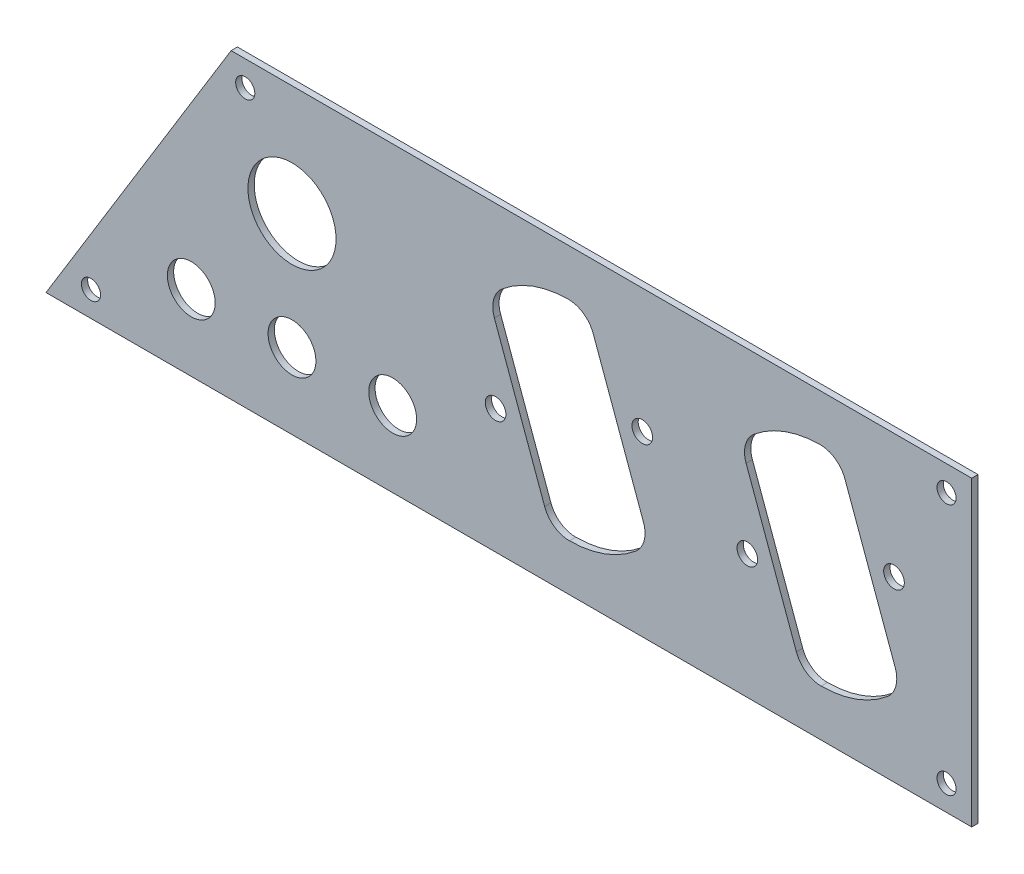
ISO-10303-21;
HEADER;
FILE_DESCRIPTION(('STEP AP214'),'2;1');
FILE_NAME('part.step','',(''),(''),'','','');
FILE_SCHEMA(('AUTOMOTIVE_DESIGN { 1 0 10303 214 1 1 1 1 }'));
ENDSEC;
DATA;
#1=APPLICATION_CONTEXT('core data for automotive mechanical design processes');
#2=APPLICATION_PROTOCOL_DEFINITION('international standard','automotive_design',2000,#1);
#3=PRODUCT_CONTEXT('',#1,'mechanical');
#4=PRODUCT('Part','Part','',(#3));
#5=PRODUCT_RELATED_PRODUCT_CATEGORY('part','',(#4));
#6=PRODUCT_DEFINITION_FORMATION('','',#4);
#7=PRODUCT_DEFINITION_CONTEXT('part definition',#1,'design');
#8=PRODUCT_DEFINITION('design','',#6,#7);
#9=PRODUCT_DEFINITION_SHAPE('','',#8);
#10=(LENGTH_UNIT() NAMED_UNIT(*) SI_UNIT(.MILLI.,.METRE.));
#11=(NAMED_UNIT(*) PLANE_ANGLE_UNIT() SI_UNIT($,.RADIAN.));
#12=(NAMED_UNIT(*) SI_UNIT($,.STERADIAN.) SOLID_ANGLE_UNIT());
#13=UNCERTAINTY_MEASURE_WITH_UNIT(LENGTH_MEASURE(1.E-05),#10,'distance_accuracy_value','');
#14=(GEOMETRIC_REPRESENTATION_CONTEXT(3) GLOBAL_UNCERTAINTY_ASSIGNED_CONTEXT((#13)) GLOBAL_UNIT_ASSIGNED_CONTEXT((#10,
#11,#12)) REPRESENTATION_CONTEXT('',''));
#15=CARTESIAN_POINT('',(0.,0.,0.));
#16=DIRECTION('',(0.,0.,1.));
#17=DIRECTION('',(1.,0.,0.));
#18=AXIS2_PLACEMENT_3D('',#15,#16,#17);
#19=CARTESIAN_POINT('',(0.,0.,1.5875));
#20=DIRECTION('',(0.,0.,1.));
#21=DIRECTION('',(1.,0.,0.));
#22=AXIS2_PLACEMENT_3D('',#19,#20,#21);
#23=PLANE('',#22);
#24=CARTESIAN_POINT('',(-83.1021507598293,-336.167333478634,1.5875));
#25=DIRECTION('',(0.,0.,1.));
#26=DIRECTION('',(1.,0.,0.));
#27=AXIS2_PLACEMENT_3D('',#24,#25,#26);
#28=CIRCLE('',#27,2.60349999999994);
#29=CARTESIAN_POINT('',(-80.4986507598294,-336.167333478634,1.5875));
#30=VERTEX_POINT('',#29);
#31=EDGE_CURVE('E256',#30,#30,#28,.T.);
#32=ORIENTED_EDGE('',*,*,#31,.F.);
#33=EDGE_LOOP('',(#32));
#34=FACE_BOUND('',#33,.T.);
#35=CARTESIAN_POINT('',(-19.6021507598293,-336.167333478634,1.5875));
#36=DIRECTION('',(0.,0.,1.));
#37=DIRECTION('',(1.,0.,0.));
#38=AXIS2_PLACEMENT_3D('',#35,#36,#37);
#39=CIRCLE('',#38,2.60349999999994);
#40=CARTESIAN_POINT('',(-16.9986507598294,-336.167333478634,1.5875));
#41=VERTEX_POINT('',#40);
#42=EDGE_CURVE('E328',#41,#41,#39,.T.);
#43=ORIENTED_EDGE('',*,*,#42,.F.);
#44=EDGE_LOOP('',(#43));
#45=FACE_BOUND('',#44,.T.);
#46=CARTESIAN_POINT('',(-222.156189245481,-374.65,1.5875));
#47=DIRECTION('',(0.,0.,1.));
#48=DIRECTION('',(1.,0.,0.));
#49=AXIS2_PLACEMENT_3D('',#46,#47,#48);
#50=CIRCLE('',#49,2.413);
#51=CARTESIAN_POINT('',(-219.743189245481,-374.65,1.5875));
#52=VERTEX_POINT('',#51);
#53=EDGE_CURVE('E340',#52,#52,#50,.T.);
#54=ORIENTED_EDGE('',*,*,#53,.F.);
#55=EDGE_LOOP('',(#54));
#56=FACE_BOUND('',#55,.T.);
#57=CARTESIAN_POINT('',(-6.34999999999997,-311.15,1.5875));
#58=DIRECTION('',(0.,0.,1.));
#59=DIRECTION('',(1.,0.,0.));
#60=AXIS2_PLACEMENT_3D('',#57,#58,#59);
#61=CIRCLE('',#60,2.413);
#62=CARTESIAN_POINT('',(-3.93699999999996,-311.15,1.5875));
#63=VERTEX_POINT('',#62);
#64=EDGE_CURVE('E352',#63,#63,#61,.T.);
#65=ORIENTED_EDGE('',*,*,#64,.F.);
#66=EDGE_LOOP('',(#65));
#67=FACE_BOUND('',#66,.T.);
#68=CARTESIAN_POINT('',(-171.45,-361.95,1.5875));
#69=DIRECTION('',(0.,0.,1.));
#70=DIRECTION('',(1.,0.,0.));
#71=AXIS2_PLACEMENT_3D('',#68,#69,#70);
#72=CIRCLE('',#71,6.03249999999993);
#73=CARTESIAN_POINT('',(-165.4175,-361.95,1.5875));
#74=VERTEX_POINT('',#73);
#75=EDGE_CURVE('E364',#74,#74,#72,.T.);
#76=ORIENTED_EDGE('',*,*,#75,.F.);
#77=EDGE_LOOP('',(#76));
#78=FACE_BOUND('',#77,.T.);
#79=CARTESIAN_POINT('',(-171.45,-332.74,1.5875));
#80=DIRECTION('',(0.,0.,1.));
#81=DIRECTION('',(1.,0.,0.));
#82=AXIS2_PLACEMENT_3D('',#79,#80,#81);
#83=CIRCLE('',#82,11.1125);
#84=CARTESIAN_POINT('',(-160.3375,-332.74,1.5875));
#85=VERTEX_POINT('',#84);
#86=EDGE_CURVE('E376',#85,#85,#83,.T.);
#87=ORIENTED_EDGE('',*,*,#86,.F.);
#88=EDGE_LOOP('',(#87));
#89=FACE_BOUND('',#88,.T.);
#90=DIRECTION('',(1.,0.,0.));
#91=VECTOR('',#90,1.);
#92=CARTESIAN_POINT('',(0.,-381.,1.5875));
#93=LINE('',#92,#91);
#94=CARTESIAN_POINT('',(-233.495394339495,-381.,1.5875));
#95=VERTEX_POINT('',#94);
#96=CARTESIAN_POINT('',(0.,-381.,1.5875));
#97=VERTEX_POINT('',#96);
#98=EDGE_CURVE('E382',#95,#97,#93,.T.);
#99=ORIENTED_EDGE('',*,*,#98,.T.);
#100=DIRECTION('',(0.,1.,0.));
#101=VECTOR('',#100,1.);
#102=CARTESIAN_POINT('',(0.,-304.8,1.5875));
#103=LINE('',#102,#101);
#104=CARTESIAN_POINT('',(0.,-304.8,1.5875));
#105=VERTEX_POINT('',#104);
#106=EDGE_CURVE('E385',#97,#105,#103,.T.);
#107=ORIENTED_EDGE('',*,*,#106,.T.);
#108=DIRECTION('',(-1.,0.,0.));
#109=VECTOR('',#108,1.);
#110=CARTESIAN_POINT('',(-186.796315471596,-304.8,1.5875));
#111=LINE('',#110,#109);
#112=CARTESIAN_POINT('',(-186.796315471596,-304.8,1.5875));
#113=VERTEX_POINT('',#112);
#114=EDGE_CURVE('E388',#105,#113,#111,.T.);
#115=ORIENTED_EDGE('',*,*,#114,.T.);
#116=DIRECTION('',(-0.522528327154028,-0.852621925194053,0.));
#117=VECTOR('',#116,1.);
#118=CARTESIAN_POINT('',(-233.495394339495,-381.,1.5875));
#119=LINE('',#118,#117);
#120=EDGE_CURVE('E390',#113,#95,#119,.T.);
#121=ORIENTED_EDGE('',*,*,#120,.T.);
#122=EDGE_LOOP('',(#99,#107,#115,#121));
#123=FACE_BOUND('',#122,.T.);
#124=CARTESIAN_POINT('',(-196.85,-361.95,1.5875));
#125=DIRECTION('',(0.,0.,1.));
#126=DIRECTION('',(1.,0.,0.));
#127=AXIS2_PLACEMENT_3D('',#124,#125,#126);
#128=CIRCLE('',#127,6.03249999999993);
#129=CARTESIAN_POINT('',(-190.8175,-361.95,1.5875));
#130=VERTEX_POINT('',#129);
#131=EDGE_CURVE('E370',#130,#130,#128,.T.);
#132=ORIENTED_EDGE('',*,*,#131,.F.);
#133=EDGE_LOOP('',(#132));
#134=FACE_BOUND('',#133,.T.);
#135=CARTESIAN_POINT('',(-146.05,-361.95,1.5875));
#136=DIRECTION('',(0.,0.,1.));
#137=DIRECTION('',(1.,0.,0.));
#138=AXIS2_PLACEMENT_3D('',#135,#136,#137);
#139=CIRCLE('',#138,6.03249999999993);
#140=CARTESIAN_POINT('',(-140.0175,-361.95,1.5875));
#141=VERTEX_POINT('',#140);
#142=EDGE_CURVE('E358',#141,#141,#139,.T.);
#143=ORIENTED_EDGE('',*,*,#142,.F.);
#144=EDGE_LOOP('',(#143));
#145=FACE_BOUND('',#144,.T.);
#146=CARTESIAN_POINT('',(-6.34999999999995,-374.65,1.5875));
#147=DIRECTION('',(0.,0.,1.));
#148=DIRECTION('',(1.,0.,0.));
#149=AXIS2_PLACEMENT_3D('',#146,#147,#148);
#150=CIRCLE('',#149,2.413);
#151=CARTESIAN_POINT('',(-3.93699999999995,-374.65,1.5875));
#152=VERTEX_POINT('',#151);
#153=EDGE_CURVE('E346',#152,#152,#150,.T.);
#154=ORIENTED_EDGE('',*,*,#153,.F.);
#155=EDGE_LOOP('',(#154));
#156=FACE_BOUND('',#155,.T.);
#157=CARTESIAN_POINT('',(-183.240290188899,-311.15,1.5875));
#158=DIRECTION('',(0.,0.,1.));
#159=DIRECTION('',(1.,0.,0.));
#160=AXIS2_PLACEMENT_3D('',#157,#158,#159);
#161=CIRCLE('',#160,2.413);
#162=CARTESIAN_POINT('',(-180.827290188899,-311.15,1.5875));
#163=VERTEX_POINT('',#162);
#164=EDGE_CURVE('E334',#163,#163,#161,.T.);
#165=ORIENTED_EDGE('',*,*,#164,.F.);
#166=EDGE_LOOP('',(#165));
#167=FACE_BOUND('',#166,.T.);
#168=CARTESIAN_POINT('',(-56.5978492401706,-349.632666521366,1.5875));
#169=DIRECTION('',(0.,0.,1.));
#170=DIRECTION('',(1.,0.,0.));
#171=AXIS2_PLACEMENT_3D('',#168,#169,#170);
#172=CIRCLE('',#171,2.60349999999996);
#173=CARTESIAN_POINT('',(-53.9943492401706,-349.632666521366,1.5875));
#174=VERTEX_POINT('',#173);
#175=EDGE_CURVE('E322',#174,#174,#172,.T.);
#176=ORIENTED_EDGE('',*,*,#175,.F.);
#177=EDGE_LOOP('',(#176));
#178=FACE_BOUND('',#177,.T.);
#179=CARTESIAN_POINT('',(-38.0847052467851,-342.942021989095,1.5875));
#180=DIRECTION('',(0.,0.,1.));
#181=DIRECTION('',(1.,0.,0.));
#182=AXIS2_PLACEMENT_3D('',#179,#180,#181);
#183=CIRCLE('',#182,26.2702188667497);
#184=CARTESIAN_POINT('',(-37.9837385493268,-369.212046827928,1.5875));
#185=VERTEX_POINT('',#184);
#186=CARTESIAN_POINT('',(-21.2760037517532,-363.130928679598,1.5875));
#187=VERTEX_POINT('',#186);
#188=EDGE_CURVE('E264',#185,#187,#183,.T.);
#189=ORIENTED_EDGE('',*,*,#188,.F.);
#190=CARTESIAN_POINT('',(-38.00912029713,-362.608095604087,1.5875));
#191=DIRECTION('',(0.,0.,1.));
#192=DIRECTION('',(1.,0.,0.));
#193=AXIS2_PLACEMENT_3D('',#190,#191,#192);
#194=CIRCLE('',#193,6.60399999999998);
#195=CARTESIAN_POINT('',(-44.2148503648002,-364.866796630609,1.5875));
#196=VERTEX_POINT('',#195);
#197=EDGE_CURVE('E262',#196,#185,#194,.T.);
#198=ORIENTED_EDGE('',*,*,#197,.F.);
#199=DIRECTION('',(0.342020143325664,-0.93969262078591,0.));
#200=VECTOR('',#199,1.);
#201=CARTESIAN_POINT('',(-56.9042318411188,-330.003007557578,1.5875));
#202=LINE('',#201,#200);
#203=CARTESIAN_POINT('',(-56.9042318411188,-330.003007557578,1.5875));
#204=VERTEX_POINT('',#203);
#205=EDGE_CURVE('E278',#204,#196,#202,.T.);
#206=ORIENTED_EDGE('',*,*,#205,.F.);
#207=CARTESIAN_POINT('',(-50.6985017734487,-327.744306531055,1.5875));
#208=DIRECTION('',(0.,0.,1.));
#209=DIRECTION('',(1.,0.,0.));
#210=AXIS2_PLACEMENT_3D('',#207,#208,#209);
#211=CIRCLE('',#210,6.60399999999997);
#212=CARTESIAN_POINT('',(-54.9239962482469,-322.669071320402,1.5875));
#213=VERTEX_POINT('',#212);
#214=EDGE_CURVE('E275',#213,#204,#211,.T.);
#215=ORIENTED_EDGE('',*,*,#214,.F.);
#216=CARTESIAN_POINT('',(-38.1152947532151,-342.857978010905,1.5875));
#217=DIRECTION('',(0.,0.,1.));
#218=DIRECTION('',(-1.,0.,0.));
#219=AXIS2_PLACEMENT_3D('',#216,#217,#218);
#220=CIRCLE('',#219,26.2702188667497);
#221=CARTESIAN_POINT('',(-38.2162614506733,-316.587953172072,1.5875));
#222=VERTEX_POINT('',#221);
#223=EDGE_CURVE('E273',#222,#213,#220,.T.);
#224=ORIENTED_EDGE('',*,*,#223,.F.);
#225=CARTESIAN_POINT('',(-38.19087970287,-323.191904395913,1.5875));
#226=DIRECTION('',(0.,0.,1.));
#227=DIRECTION('',(-1.,0.,0.));
#228=AXIS2_PLACEMENT_3D('',#225,#226,#227);
#229=CIRCLE('',#228,6.604);
#230=CARTESIAN_POINT('',(-31.9851496351998,-320.933203369391,1.5875));
#231=VERTEX_POINT('',#230);
#232=EDGE_CURVE('E271',#231,#222,#229,.T.);
#233=ORIENTED_EDGE('',*,*,#232,.F.);
#234=DIRECTION('',(-0.342020143325664,0.93969262078591,0.));
#235=VECTOR('',#234,1.);
#236=CARTESIAN_POINT('',(-31.9851496351998,-320.933203369391,1.5875));
#237=LINE('',#236,#235);
#238=CARTESIAN_POINT('',(-19.2957681588812,-355.796992442422,1.5875));
#239=VERTEX_POINT('',#238);
#240=EDGE_CURVE('E269',#239,#231,#237,.T.);
#241=ORIENTED_EDGE('',*,*,#240,.F.);
#242=CARTESIAN_POINT('',(-25.5014982265514,-358.055693468945,1.5875));
#243=DIRECTION('',(0.,0.,1.));
#244=DIRECTION('',(1.,0.,0.));
#245=AXIS2_PLACEMENT_3D('',#242,#243,#244);
#246=CIRCLE('',#245,6.60400000000003);
#247=EDGE_CURVE('E267',#187,#239,#246,.T.);
#248=ORIENTED_EDGE('',*,*,#247,.F.);
#249=EDGE_LOOP('',(#189,#198,#206,#215,#224,#233,#241,#248));
#250=FACE_BOUND('',#249,.T.);
#251=CARTESIAN_POINT('',(-120.097849240171,-349.632666521366,1.5875));
#252=DIRECTION('',(0.,0.,1.));
#253=DIRECTION('',(1.,0.,0.));
#254=AXIS2_PLACEMENT_3D('',#251,#252,#253);
#255=CIRCLE('',#254,2.60349999999996);
#256=CARTESIAN_POINT('',(-117.494349240171,-349.632666521366,1.5875));
#257=VERTEX_POINT('',#256);
#258=EDGE_CURVE('E250',#257,#257,#255,.T.);
#259=ORIENTED_EDGE('',*,*,#258,.F.);
#260=EDGE_LOOP('',(#259));
#261=FACE_BOUND('',#260,.T.);
#262=CARTESIAN_POINT('',(-101.584705246785,-342.942021989095,1.5875));
#263=DIRECTION('',(0.,0.,1.));
#264=DIRECTION('',(1.,0.,0.));
#265=AXIS2_PLACEMENT_3D('',#262,#263,#264);
#266=CIRCLE('',#265,26.2702188667497);
#267=CARTESIAN_POINT('',(-101.483738549327,-369.212046827928,1.5875));
#268=VERTEX_POINT('',#267);
#269=CARTESIAN_POINT('',(-84.7760037517532,-363.130928679598,1.5875));
#270=VERTEX_POINT('',#269);
#271=EDGE_CURVE('E191',#268,#270,#266,.T.);
#272=ORIENTED_EDGE('',*,*,#271,.F.);
#273=CARTESIAN_POINT('',(-101.50912029713,-362.608095604087,1.5875));
#274=DIRECTION('',(0.,0.,1.));
#275=DIRECTION('',(1.,0.,0.));
#276=AXIS2_PLACEMENT_3D('',#273,#274,#275);
#277=CIRCLE('',#276,6.60399999999999);
#278=CARTESIAN_POINT('',(-107.7148503648,-364.866796630609,1.5875));
#279=VERTEX_POINT('',#278);
#280=EDGE_CURVE('E183',#279,#268,#277,.T.);
#281=ORIENTED_EDGE('',*,*,#280,.F.);
#282=DIRECTION('',(0.342020143325664,-0.93969262078591,0.));
#283=VECTOR('',#282,1.);
#284=CARTESIAN_POINT('',(-120.404231841119,-330.003007557578,1.5875));
#285=LINE('',#284,#283);
#286=CARTESIAN_POINT('',(-120.404231841119,-330.003007557578,1.5875));
#287=VERTEX_POINT('',#286);
#288=EDGE_CURVE('E216',#287,#279,#285,.T.);
#289=ORIENTED_EDGE('',*,*,#288,.F.);
#290=CARTESIAN_POINT('',(-114.198501773449,-327.744306531055,1.5875));
#291=DIRECTION('',(0.,0.,1.));
#292=DIRECTION('',(1.,0.,0.));
#293=AXIS2_PLACEMENT_3D('',#290,#291,#292);
#294=CIRCLE('',#293,6.60399999999997);
#295=CARTESIAN_POINT('',(-118.423996248247,-322.669071320402,1.5875));
#296=VERTEX_POINT('',#295);
#297=EDGE_CURVE('E214',#296,#287,#294,.T.);
#298=ORIENTED_EDGE('',*,*,#297,.F.);
#299=CARTESIAN_POINT('',(-101.615294753215,-342.857978010905,1.5875));
#300=DIRECTION('',(0.,0.,1.));
#301=DIRECTION('',(-1.,0.,0.));
#302=AXIS2_PLACEMENT_3D('',#299,#300,#301);
#303=CIRCLE('',#302,26.2702188667497);
#304=CARTESIAN_POINT('',(-101.716261450673,-316.587953172072,1.5875));
#305=VERTEX_POINT('',#304);
#306=EDGE_CURVE('E212',#305,#296,#303,.T.);
#307=ORIENTED_EDGE('',*,*,#306,.F.);
#308=CARTESIAN_POINT('',(-101.69087970287,-323.191904395913,1.5875));
#309=DIRECTION('',(0.,0.,1.));
#310=DIRECTION('',(-1.,0.,0.));
#311=AXIS2_PLACEMENT_3D('',#308,#309,#310);
#312=CIRCLE('',#311,6.604);
#313=CARTESIAN_POINT('',(-95.4851496351998,-320.933203369391,1.5875));
#314=VERTEX_POINT('',#313);
#315=EDGE_CURVE('E210',#314,#305,#312,.T.);
#316=ORIENTED_EDGE('',*,*,#315,.F.);
#317=DIRECTION('',(-0.342020143325664,0.93969262078591,0.));
#318=VECTOR('',#317,1.);
#319=CARTESIAN_POINT('',(-95.4851496351998,-320.933203369391,1.5875));
#320=LINE('',#319,#318);
#321=CARTESIAN_POINT('',(-82.7957681588812,-355.796992442422,1.5875));
#322=VERTEX_POINT('',#321);
#323=EDGE_CURVE('E206',#322,#314,#320,.T.);
#324=ORIENTED_EDGE('',*,*,#323,.F.);
#325=CARTESIAN_POINT('',(-89.0014982265514,-358.055693468945,1.5875));
#326=DIRECTION('',(0.,0.,1.));
#327=DIRECTION('',(1.,0.,0.));
#328=AXIS2_PLACEMENT_3D('',#325,#326,#327);
#329=CIRCLE('',#328,6.60400000000003);
#330=EDGE_CURVE('E204',#270,#322,#329,.T.);
#331=ORIENTED_EDGE('',*,*,#330,.F.);
#332=EDGE_LOOP('',(#272,#281,#289,#298,#307,#316,#324,#331));
#333=FACE_BOUND('',#332,.T.);
#334=ADVANCED_FACE('F46',(#34,#45,#56,#67,#78,#89,#123,#134,#145,#156,#167,#178,#250,#261,#333),
#23,.T.);
#335=CARTESIAN_POINT('',(0.,0.,0.));
#336=DIRECTION('',(0.,0.,1.));
#337=DIRECTION('',(1.,0.,0.));
#338=AXIS2_PLACEMENT_3D('',#335,#336,#337);
#339=PLANE('',#338);
#340=CARTESIAN_POINT('',(-120.097849240171,-349.632666521366,0.));
#341=DIRECTION('',(0.,0.,1.));
#342=DIRECTION('',(1.,0.,0.));
#343=AXIS2_PLACEMENT_3D('',#340,#341,#342);
#344=CIRCLE('',#343,2.60349999999996);
#345=CARTESIAN_POINT('',(-117.494349240171,-349.632666521366,0.));
#346=VERTEX_POINT('',#345);
#347=EDGE_CURVE('E199',#346,#346,#344,.T.);
#348=ORIENTED_EDGE('',*,*,#347,.T.);
#349=EDGE_LOOP('',(#348));
#350=FACE_BOUND('',#349,.T.);
#351=CARTESIAN_POINT('',(-83.1021507598293,-336.167333478634,0.));
#352=DIRECTION('',(0.,0.,1.));
#353=DIRECTION('',(1.,0.,0.));
#354=AXIS2_PLACEMENT_3D('',#351,#352,#353);
#355=CIRCLE('',#354,2.60349999999994);
#356=CARTESIAN_POINT('',(-80.4986507598294,-336.167333478634,0.));
#357=VERTEX_POINT('',#356);
#358=EDGE_CURVE('E253',#357,#357,#355,.T.);
#359=ORIENTED_EDGE('',*,*,#358,.T.);
#360=EDGE_LOOP('',(#359));
#361=FACE_BOUND('',#360,.T.);
#362=CARTESIAN_POINT('',(-38.00912029713,-362.608095604087,0.));
#363=DIRECTION('',(0.,0.,1.));
#364=DIRECTION('',(1.,0.,0.));
#365=AXIS2_PLACEMENT_3D('',#362,#363,#364);
#366=CIRCLE('',#365,6.60399999999998);
#367=CARTESIAN_POINT('',(-44.2148503648002,-364.866796630609,0.));
#368=VERTEX_POINT('',#367);
#369=CARTESIAN_POINT('',(-37.9837385493268,-369.212046827928,0.));
#370=VERTEX_POINT('',#369);
#371=EDGE_CURVE('E259',#368,#370,#366,.T.);
#372=ORIENTED_EDGE('',*,*,#371,.T.);
#373=CARTESIAN_POINT('',(-38.0847052467851,-342.942021989095,0.));
#374=DIRECTION('',(0.,0.,1.));
#375=DIRECTION('',(1.,0.,0.));
#376=AXIS2_PLACEMENT_3D('',#373,#374,#375);
#377=CIRCLE('',#376,26.2702188667497);
#378=CARTESIAN_POINT('',(-21.2760037517532,-363.130928679598,0.));
#379=VERTEX_POINT('',#378);
#380=EDGE_CURVE('E284',#370,#379,#377,.T.);
#381=ORIENTED_EDGE('',*,*,#380,.T.);
#382=CARTESIAN_POINT('',(-25.5014982265514,-358.055693468945,0.));
#383=DIRECTION('',(0.,0.,1.));
#384=DIRECTION('',(1.,0.,0.));
#385=AXIS2_PLACEMENT_3D('',#382,#383,#384);
#386=CIRCLE('',#385,6.60400000000003);
#387=CARTESIAN_POINT('',(-19.2957681588812,-355.796992442422,0.));
#388=VERTEX_POINT('',#387);
#389=EDGE_CURVE('E287',#379,#388,#386,.T.);
#390=ORIENTED_EDGE('',*,*,#389,.T.);
#391=DIRECTION('',(-0.342020143325664,0.93969262078591,0.));
#392=VECTOR('',#391,1.);
#393=CARTESIAN_POINT('',(-31.9851496351998,-320.933203369391,0.));
#394=LINE('',#393,#392);
#395=CARTESIAN_POINT('',(-31.9851496351998,-320.933203369391,0.));
#396=VERTEX_POINT('',#395);
#397=EDGE_CURVE('E290',#388,#396,#394,.T.);
#398=ORIENTED_EDGE('',*,*,#397,.T.);
#399=CARTESIAN_POINT('',(-38.19087970287,-323.191904395913,0.));
#400=DIRECTION('',(0.,0.,1.));
#401=DIRECTION('',(-1.,0.,0.));
#402=AXIS2_PLACEMENT_3D('',#399,#400,#401);
#403=CIRCLE('',#402,6.604);
#404=CARTESIAN_POINT('',(-38.2162614506733,-316.587953172072,0.));
#405=VERTEX_POINT('',#404);
#406=EDGE_CURVE('E293',#396,#405,#403,.T.);
#407=ORIENTED_EDGE('',*,*,#406,.T.);
#408=CARTESIAN_POINT('',(-38.1152947532151,-342.857978010905,0.));
#409=DIRECTION('',(0.,0.,1.));
#410=DIRECTION('',(-1.,0.,0.));
#411=AXIS2_PLACEMENT_3D('',#408,#409,#410);
#412=CIRCLE('',#411,26.2702188667497);
#413=CARTESIAN_POINT('',(-54.9239962482469,-322.669071320402,0.));
#414=VERTEX_POINT('',#413);
#415=EDGE_CURVE('E296',#405,#414,#412,.T.);
#416=ORIENTED_EDGE('',*,*,#415,.T.);
#417=CARTESIAN_POINT('',(-50.6985017734487,-327.744306531055,0.));
#418=DIRECTION('',(0.,0.,1.));
#419=DIRECTION('',(1.,0.,0.));
#420=AXIS2_PLACEMENT_3D('',#417,#418,#419);
#421=CIRCLE('',#420,6.60399999999997);
#422=CARTESIAN_POINT('',(-56.9042318411188,-330.003007557578,0.));
#423=VERTEX_POINT('',#422);
#424=EDGE_CURVE('E299',#414,#423,#421,.T.);
#425=ORIENTED_EDGE('',*,*,#424,.T.);
#426=DIRECTION('',(0.342020143325664,-0.93969262078591,0.));
#427=VECTOR('',#426,1.);
#428=CARTESIAN_POINT('',(-56.9042318411188,-330.003007557578,0.));
#429=LINE('',#428,#427);
#430=EDGE_CURVE('E265',#423,#368,#429,.T.);
#431=ORIENTED_EDGE('',*,*,#430,.T.);
#432=EDGE_LOOP('',(#372,#381,#390,#398,#407,#416,#425,#431));
#433=FACE_BOUND('',#432,.T.);
#434=DIRECTION('',(1.,0.,0.));
#435=VECTOR('',#434,1.);
#436=CARTESIAN_POINT('',(0.,-381.,0.));
#437=LINE('',#436,#435);
#438=CARTESIAN_POINT('',(-233.495394339495,-381.,0.));
#439=VERTEX_POINT('',#438);
#440=CARTESIAN_POINT('',(0.,-381.,0.));
#441=VERTEX_POINT('',#440);
#442=EDGE_CURVE('E379',#439,#441,#437,.T.);
#443=ORIENTED_EDGE('',*,*,#442,.F.);
#444=DIRECTION('',(-0.522528327154028,-0.852621925194053,0.));
#445=VECTOR('',#444,1.);
#446=CARTESIAN_POINT('',(-233.495394339495,-381.,0.));
#447=LINE('',#446,#445);
#448=CARTESIAN_POINT('',(-186.796315471596,-304.8,0.));
#449=VERTEX_POINT('',#448);
#450=EDGE_CURVE('E386',#449,#439,#447,.T.);
#451=ORIENTED_EDGE('',*,*,#450,.F.);
#452=DIRECTION('',(-1.,0.,0.));
#453=VECTOR('',#452,1.);
#454=CARTESIAN_POINT('',(-186.796315471596,-304.8,0.));
#455=LINE('',#454,#453);
#456=CARTESIAN_POINT('',(0.,-304.8,0.));
#457=VERTEX_POINT('',#456);
#458=EDGE_CURVE('E397',#457,#449,#455,.T.);
#459=ORIENTED_EDGE('',*,*,#458,.F.);
#460=DIRECTION('',(0.,1.,0.));
#461=VECTOR('',#460,1.);
#462=CARTESIAN_POINT('',(0.,-304.8,0.));
#463=LINE('',#462,#461);
#464=EDGE_CURVE('E395',#441,#457,#463,.T.);
#465=ORIENTED_EDGE('',*,*,#464,.F.);
#466=EDGE_LOOP('',(#443,#451,#459,#465));
#467=FACE_BOUND('',#466,.T.);
#468=CARTESIAN_POINT('',(-171.45,-332.74,0.));
#469=DIRECTION('',(0.,0.,1.));
#470=DIRECTION('',(1.,0.,0.));
#471=AXIS2_PLACEMENT_3D('',#468,#469,#470);
#472=CIRCLE('',#471,11.1125);
#473=CARTESIAN_POINT('',(-160.3375,-332.74,0.));
#474=VERTEX_POINT('',#473);
#475=EDGE_CURVE('E373',#474,#474,#472,.T.);
#476=ORIENTED_EDGE('',*,*,#475,.T.);
#477=EDGE_LOOP('',(#476));
#478=FACE_BOUND('',#477,.T.);
#479=CARTESIAN_POINT('',(-196.85,-361.95,0.));
#480=DIRECTION('',(0.,0.,1.));
#481=DIRECTION('',(1.,0.,0.));
#482=AXIS2_PLACEMENT_3D('',#479,#480,#481);
#483=CIRCLE('',#482,6.03249999999993);
#484=CARTESIAN_POINT('',(-190.8175,-361.95,0.));
#485=VERTEX_POINT('',#484);
#486=EDGE_CURVE('E367',#485,#485,#483,.T.);
#487=ORIENTED_EDGE('',*,*,#486,.T.);
#488=EDGE_LOOP('',(#487));
#489=FACE_BOUND('',#488,.T.);
#490=CARTESIAN_POINT('',(-171.45,-361.95,0.));
#491=DIRECTION('',(0.,0.,1.));
#492=DIRECTION('',(1.,0.,0.));
#493=AXIS2_PLACEMENT_3D('',#490,#491,#492);
#494=CIRCLE('',#493,6.03249999999993);
#495=CARTESIAN_POINT('',(-165.4175,-361.95,0.));
#496=VERTEX_POINT('',#495);
#497=EDGE_CURVE('E361',#496,#496,#494,.T.);
#498=ORIENTED_EDGE('',*,*,#497,.T.);
#499=EDGE_LOOP('',(#498));
#500=FACE_BOUND('',#499,.T.);
#501=CARTESIAN_POINT('',(-146.05,-361.95,0.));
#502=DIRECTION('',(0.,0.,1.));
#503=DIRECTION('',(1.,0.,0.));
#504=AXIS2_PLACEMENT_3D('',#501,#502,#503);
#505=CIRCLE('',#504,6.03249999999993);
#506=CARTESIAN_POINT('',(-140.0175,-361.95,0.));
#507=VERTEX_POINT('',#506);
#508=EDGE_CURVE('E355',#507,#507,#505,.T.);
#509=ORIENTED_EDGE('',*,*,#508,.T.);
#510=EDGE_LOOP('',(#509));
#511=FACE_BOUND('',#510,.T.);
#512=CARTESIAN_POINT('',(-6.34999999999997,-311.15,0.));
#513=DIRECTION('',(0.,0.,1.));
#514=DIRECTION('',(1.,0.,0.));
#515=AXIS2_PLACEMENT_3D('',#512,#513,#514);
#516=CIRCLE('',#515,2.413);
#517=CARTESIAN_POINT('',(-3.93699999999996,-311.15,0.));
#518=VERTEX_POINT('',#517);
#519=EDGE_CURVE('E349',#518,#518,#516,.T.);
#520=ORIENTED_EDGE('',*,*,#519,.T.);
#521=EDGE_LOOP('',(#520));
#522=FACE_BOUND('',#521,.T.);
#523=CARTESIAN_POINT('',(-6.34999999999995,-374.65,0.));
#524=DIRECTION('',(0.,0.,1.));
#525=DIRECTION('',(1.,0.,0.));
#526=AXIS2_PLACEMENT_3D('',#523,#524,#525);
#527=CIRCLE('',#526,2.413);
#528=CARTESIAN_POINT('',(-3.93699999999995,-374.65,0.));
#529=VERTEX_POINT('',#528);
#530=EDGE_CURVE('E343',#529,#529,#527,.T.);
#531=ORIENTED_EDGE('',*,*,#530,.T.);
#532=EDGE_LOOP('',(#531));
#533=FACE_BOUND('',#532,.T.);
#534=CARTESIAN_POINT('',(-222.156189245481,-374.65,0.));
#535=DIRECTION('',(0.,0.,1.));
#536=DIRECTION('',(1.,0.,0.));
#537=AXIS2_PLACEMENT_3D('',#534,#535,#536);
#538=CIRCLE('',#537,2.413);
#539=CARTESIAN_POINT('',(-219.743189245481,-374.65,0.));
#540=VERTEX_POINT('',#539);
#541=EDGE_CURVE('E337',#540,#540,#538,.T.);
#542=ORIENTED_EDGE('',*,*,#541,.T.);
#543=EDGE_LOOP('',(#542));
#544=FACE_BOUND('',#543,.T.);
#545=CARTESIAN_POINT('',(-183.240290188899,-311.15,0.));
#546=DIRECTION('',(0.,0.,1.));
#547=DIRECTION('',(1.,0.,0.));
#548=AXIS2_PLACEMENT_3D('',#545,#546,#547);
#549=CIRCLE('',#548,2.413);
#550=CARTESIAN_POINT('',(-180.827290188899,-311.15,0.));
#551=VERTEX_POINT('',#550);
#552=EDGE_CURVE('E331',#551,#551,#549,.T.);
#553=ORIENTED_EDGE('',*,*,#552,.T.);
#554=EDGE_LOOP('',(#553));
#555=FACE_BOUND('',#554,.T.);
#556=CARTESIAN_POINT('',(-19.6021507598293,-336.167333478634,0.));
#557=DIRECTION('',(0.,0.,1.));
#558=DIRECTION('',(1.,0.,0.));
#559=AXIS2_PLACEMENT_3D('',#556,#557,#558);
#560=CIRCLE('',#559,2.60349999999994);
#561=CARTESIAN_POINT('',(-16.9986507598294,-336.167333478634,0.));
#562=VERTEX_POINT('',#561);
#563=EDGE_CURVE('E325',#562,#562,#560,.T.);
#564=ORIENTED_EDGE('',*,*,#563,.T.);
#565=EDGE_LOOP('',(#564));
#566=FACE_BOUND('',#565,.T.);
#567=CARTESIAN_POINT('',(-56.5978492401706,-349.632666521366,0.));
#568=DIRECTION('',(0.,0.,1.));
#569=DIRECTION('',(1.,0.,0.));
#570=AXIS2_PLACEMENT_3D('',#567,#568,#569);
#571=CIRCLE('',#570,2.60349999999996);
#572=CARTESIAN_POINT('',(-53.9943492401706,-349.632666521366,0.));
#573=VERTEX_POINT('',#572);
#574=EDGE_CURVE('E321',#573,#573,#571,.T.);
#575=ORIENTED_EDGE('',*,*,#574,.T.);
#576=EDGE_LOOP('',(#575));
#577=FACE_BOUND('',#576,.T.);
#578=CARTESIAN_POINT('',(-101.50912029713,-362.608095604087,0.));
#579=DIRECTION('',(0.,0.,1.));
#580=DIRECTION('',(1.,0.,0.));
#581=AXIS2_PLACEMENT_3D('',#578,#579,#580);
#582=CIRCLE('',#581,6.60399999999999);
#583=CARTESIAN_POINT('',(-107.7148503648,-364.866796630609,0.));
#584=VERTEX_POINT('',#583);
#585=CARTESIAN_POINT('',(-101.483738549327,-369.212046827928,0.));
#586=VERTEX_POINT('',#585);
#587=EDGE_CURVE('E69',#584,#586,#582,.T.);
#588=ORIENTED_EDGE('',*,*,#587,.T.);
#589=CARTESIAN_POINT('',(-101.584705246785,-342.942021989095,0.));
#590=DIRECTION('',(0.,0.,1.));
#591=DIRECTION('',(1.,0.,0.));
#592=AXIS2_PLACEMENT_3D('',#589,#590,#591);
#593=CIRCLE('',#592,26.2702188667497);
#594=CARTESIAN_POINT('',(-84.7760037517532,-363.130928679598,0.));
#595=VERTEX_POINT('',#594);
#596=EDGE_CURVE('E198',#586,#595,#593,.T.);
#597=ORIENTED_EDGE('',*,*,#596,.T.);
#598=CARTESIAN_POINT('',(-89.0014982265514,-358.055693468945,0.));
#599=DIRECTION('',(0.,0.,1.));
#600=DIRECTION('',(1.,0.,0.));
#601=AXIS2_PLACEMENT_3D('',#598,#599,#600);
#602=CIRCLE('',#601,6.60400000000003);
#603=CARTESIAN_POINT('',(-82.7957681588812,-355.796992442422,0.));
#604=VERTEX_POINT('',#603);
#605=EDGE_CURVE('E222',#595,#604,#602,.T.);
#606=ORIENTED_EDGE('',*,*,#605,.T.);
#607=DIRECTION('',(-0.342020143325664,0.93969262078591,0.));
#608=VECTOR('',#607,1.);
#609=CARTESIAN_POINT('',(-95.4851496351998,-320.933203369391,0.));
#610=LINE('',#609,#608);
#611=CARTESIAN_POINT('',(-95.4851496351998,-320.933203369391,0.));
#612=VERTEX_POINT('',#611);
#613=EDGE_CURVE('E225',#604,#612,#610,.T.);
#614=ORIENTED_EDGE('',*,*,#613,.T.);
#615=CARTESIAN_POINT('',(-101.69087970287,-323.191904395913,0.));
#616=DIRECTION('',(0.,0.,1.));
#617=DIRECTION('',(-1.,0.,0.));
#618=AXIS2_PLACEMENT_3D('',#615,#616,#617);
#619=CIRCLE('',#618,6.604);
#620=CARTESIAN_POINT('',(-101.716261450673,-316.587953172072,0.));
#621=VERTEX_POINT('',#620);
#622=EDGE_CURVE('E228',#612,#621,#619,.T.);
#623=ORIENTED_EDGE('',*,*,#622,.T.);
#624=CARTESIAN_POINT('',(-101.615294753215,-342.857978010905,0.));
#625=DIRECTION('',(0.,0.,1.));
#626=DIRECTION('',(-1.,0.,0.));
#627=AXIS2_PLACEMENT_3D('',#624,#625,#626);
#628=CIRCLE('',#627,26.2702188667497);
#629=CARTESIAN_POINT('',(-118.423996248247,-322.669071320402,0.));
#630=VERTEX_POINT('',#629);
#631=EDGE_CURVE('E231',#621,#630,#628,.T.);
#632=ORIENTED_EDGE('',*,*,#631,.T.);
#633=CARTESIAN_POINT('',(-114.198501773449,-327.744306531055,0.));
#634=DIRECTION('',(0.,0.,1.));
#635=DIRECTION('',(1.,0.,0.));
#636=AXIS2_PLACEMENT_3D('',#633,#634,#635);
#637=CIRCLE('',#636,6.60399999999997);
#638=CARTESIAN_POINT('',(-120.404231841119,-330.003007557578,0.));
#639=VERTEX_POINT('',#638);
#640=EDGE_CURVE('E234',#630,#639,#637,.T.);
#641=ORIENTED_EDGE('',*,*,#640,.T.);
#642=DIRECTION('',(0.342020143325664,-0.93969262078591,0.));
#643=VECTOR('',#642,1.);
#644=CARTESIAN_POINT('',(-120.404231841119,-330.003007557578,0.));
#645=LINE('',#644,#643);
#646=EDGE_CURVE('E192',#639,#584,#645,.T.);
#647=ORIENTED_EDGE('',*,*,#646,.T.);
#648=EDGE_LOOP('',(#588,#597,#606,#614,#623,#632,#641,#647));
#649=FACE_BOUND('',#648,.T.);
#650=ADVANCED_FACE('F415',(#350,#361,#433,#467,#478,#489,#500,#511,#522,#533,#544,#555,#566,
#577,#649),#339,.F.);
#651=CARTESIAN_POINT('',(0.,-381.,1.5875));
#652=DIRECTION('',(0.,1.,0.));
#653=DIRECTION('',(-1.,0.,0.));
#654=AXIS2_PLACEMENT_3D('',#651,#652,#653);
#655=PLANE('',#654);
#656=ORIENTED_EDGE('',*,*,#442,.T.);
#657=DIRECTION('',(0.,0.,-1.));
#658=VECTOR('',#657,1.);
#659=CARTESIAN_POINT('',(0.,-381.,1.5875));
#660=LINE('',#659,#658);
#661=EDGE_CURVE('E12',#97,#441,#660,.T.);
#662=ORIENTED_EDGE('',*,*,#661,.F.);
#663=ORIENTED_EDGE('',*,*,#98,.F.);
#664=DIRECTION('',(0.,0.,-1.));
#665=VECTOR('',#664,1.);
#666=CARTESIAN_POINT('',(-233.495394339495,-381.,1.5875));
#667=LINE('',#666,#665);
#668=EDGE_CURVE('E392',#95,#439,#667,.T.);
#669=ORIENTED_EDGE('',*,*,#668,.T.);
#670=EDGE_LOOP('',(#656,#662,#663,#669));
#671=FACE_BOUND('',#670,.T.);
#672=ADVANCED_FACE('F48',(#671),#655,.F.);
#673=CARTESIAN_POINT('',(0.,-304.8,1.5875));
#674=DIRECTION('',(-1.,0.,0.));
#675=DIRECTION('',(0.,-1.,0.));
#676=AXIS2_PLACEMENT_3D('',#673,#674,#675);
#677=PLANE('',#676);
#678=ORIENTED_EDGE('',*,*,#464,.T.);
#679=DIRECTION('',(0.,0.,-1.));
#680=VECTOR('',#679,1.);
#681=CARTESIAN_POINT('',(0.,-304.8,1.5875));
#682=LINE('',#681,#680);
#683=EDGE_CURVE('E54',#105,#457,#682,.T.);
#684=ORIENTED_EDGE('',*,*,#683,.F.);
#685=ORIENTED_EDGE('',*,*,#106,.F.);
#686=ORIENTED_EDGE('',*,*,#661,.T.);
#687=EDGE_LOOP('',(#678,#684,#685,#686));
#688=FACE_BOUND('',#687,.T.);
#689=ADVANCED_FACE('F426',(#688),#677,.F.);
#690=CARTESIAN_POINT('',(-186.796315471596,-304.8,1.5875));
#691=DIRECTION('',(0.,-1.,0.));
#692=DIRECTION('',(0.,0.,-1.));
#693=AXIS2_PLACEMENT_3D('',#690,#691,#692);
#694=PLANE('',#693);
#695=ORIENTED_EDGE('',*,*,#458,.T.);
#696=DIRECTION('',(0.,0.,-1.));
#697=VECTOR('',#696,1.);
#698=CARTESIAN_POINT('',(-186.796315471596,-304.8,1.5875));
#699=LINE('',#698,#697);
#700=EDGE_CURVE('E402',#113,#449,#699,.T.);
#701=ORIENTED_EDGE('',*,*,#700,.F.);
#702=ORIENTED_EDGE('',*,*,#114,.F.);
#703=ORIENTED_EDGE('',*,*,#683,.T.);
#704=EDGE_LOOP('',(#695,#701,#702,#703));
#705=FACE_BOUND('',#704,.T.);
#706=ADVANCED_FACE('F409',(#705),#694,.F.);
#707=CARTESIAN_POINT('',(-233.495394339495,-381.,1.5875));
#708=DIRECTION('',(0.852621925194053,-0.522528327154028,0.));
#709=DIRECTION('',(0.522528327154028,0.852621925194053,0.));
#710=AXIS2_PLACEMENT_3D('',#707,#708,#709);
#711=PLANE('',#710);
#712=ORIENTED_EDGE('',*,*,#450,.T.);
#713=ORIENTED_EDGE('',*,*,#668,.F.);
#714=ORIENTED_EDGE('',*,*,#120,.F.);
#715=ORIENTED_EDGE('',*,*,#700,.T.);
#716=EDGE_LOOP('',(#712,#713,#714,#715));
#717=FACE_BOUND('',#716,.T.);
#718=ADVANCED_FACE('F419',(#717),#711,.F.);
#719=CARTESIAN_POINT('',(-171.45,-332.74,1.5875));
#720=DIRECTION('',(0.,0.,-1.));
#721=DIRECTION('',(-1.,0.,0.));
#722=AXIS2_PLACEMENT_3D('',#719,#720,#721);
#723=CYLINDRICAL_SURFACE('',#722,11.1125);
#724=ORIENTED_EDGE('',*,*,#86,.T.);
#725=EDGE_LOOP('',(#724));
#726=FACE_BOUND('',#725,.T.);
#727=ORIENTED_EDGE('',*,*,#475,.F.);
#728=EDGE_LOOP('',(#727));
#729=FACE_BOUND('',#728,.T.);
#730=ADVANCED_FACE('F444',(#726,#729),#723,.F.);
#731=CARTESIAN_POINT('',(-196.85,-361.95,1.5875));
#732=DIRECTION('',(0.,0.,-1.));
#733=DIRECTION('',(-1.,0.,0.));
#734=AXIS2_PLACEMENT_3D('',#731,#732,#733);
#735=CYLINDRICAL_SURFACE('',#734,6.03249999999993);
#736=ORIENTED_EDGE('',*,*,#131,.T.);
#737=EDGE_LOOP('',(#736));
#738=FACE_BOUND('',#737,.T.);
#739=ORIENTED_EDGE('',*,*,#486,.F.);
#740=EDGE_LOOP('',(#739));
#741=FACE_BOUND('',#740,.T.);
#742=ADVANCED_FACE('F451',(#738,#741),#735,.F.);
#743=CARTESIAN_POINT('',(-171.45,-361.95,1.5875));
#744=DIRECTION('',(0.,0.,-1.));
#745=DIRECTION('',(-1.,0.,0.));
#746=AXIS2_PLACEMENT_3D('',#743,#744,#745);
#747=CYLINDRICAL_SURFACE('',#746,6.03249999999993);
#748=ORIENTED_EDGE('',*,*,#75,.T.);
#749=EDGE_LOOP('',(#748));
#750=FACE_BOUND('',#749,.T.);
#751=ORIENTED_EDGE('',*,*,#497,.F.);
#752=EDGE_LOOP('',(#751));
#753=FACE_BOUND('',#752,.T.);
#754=ADVANCED_FACE('F456',(#750,#753),#747,.F.);
#755=CARTESIAN_POINT('',(-146.05,-361.95,1.5875));
#756=DIRECTION('',(0.,0.,-1.));
#757=DIRECTION('',(-1.,0.,0.));
#758=AXIS2_PLACEMENT_3D('',#755,#756,#757);
#759=CYLINDRICAL_SURFACE('',#758,6.03249999999993);
#760=ORIENTED_EDGE('',*,*,#142,.T.);
#761=EDGE_LOOP('',(#760));
#762=FACE_BOUND('',#761,.T.);
#763=ORIENTED_EDGE('',*,*,#508,.F.);
#764=EDGE_LOOP('',(#763));
#765=FACE_BOUND('',#764,.T.);
#766=ADVANCED_FACE('F578',(#762,#765),#759,.F.);
#767=CARTESIAN_POINT('',(-6.34999999999997,-311.15,1.5875));
#768=DIRECTION('',(0.,0.,-1.));
#769=DIRECTION('',(-1.,0.,0.));
#770=AXIS2_PLACEMENT_3D('',#767,#768,#769);
#771=CYLINDRICAL_SURFACE('',#770,2.413);
#772=ORIENTED_EDGE('',*,*,#64,.T.);
#773=EDGE_LOOP('',(#772));
#774=FACE_BOUND('',#773,.T.);
#775=ORIENTED_EDGE('',*,*,#519,.F.);
#776=EDGE_LOOP('',(#775));
#777=FACE_BOUND('',#776,.T.);
#778=ADVANCED_FACE('F574',(#774,#777),#771,.F.);
#779=CARTESIAN_POINT('',(-6.34999999999995,-374.65,1.5875));
#780=DIRECTION('',(0.,0.,-1.));
#781=DIRECTION('',(-1.,0.,0.));
#782=AXIS2_PLACEMENT_3D('',#779,#780,#781);
#783=CYLINDRICAL_SURFACE('',#782,2.413);
#784=ORIENTED_EDGE('',*,*,#153,.T.);
#785=EDGE_LOOP('',(#784));
#786=FACE_BOUND('',#785,.T.);
#787=ORIENTED_EDGE('',*,*,#530,.F.);
#788=EDGE_LOOP('',(#787));
#789=FACE_BOUND('',#788,.T.);
#790=ADVANCED_FACE('F570',(#786,#789),#783,.F.);
#791=CARTESIAN_POINT('',(-222.156189245481,-374.65,1.5875));
#792=DIRECTION('',(0.,0.,-1.));
#793=DIRECTION('',(-1.,0.,0.));
#794=AXIS2_PLACEMENT_3D('',#791,#792,#793);
#795=CYLINDRICAL_SURFACE('',#794,2.413);
#796=ORIENTED_EDGE('',*,*,#53,.T.);
#797=EDGE_LOOP('',(#796));
#798=FACE_BOUND('',#797,.T.);
#799=ORIENTED_EDGE('',*,*,#541,.F.);
#800=EDGE_LOOP('',(#799));
#801=FACE_BOUND('',#800,.T.);
#802=ADVANCED_FACE('F566',(#798,#801),#795,.F.);
#803=CARTESIAN_POINT('',(-183.240290188899,-311.15,1.5875));
#804=DIRECTION('',(0.,0.,-1.));
#805=DIRECTION('',(-1.,0.,0.));
#806=AXIS2_PLACEMENT_3D('',#803,#804,#805);
#807=CYLINDRICAL_SURFACE('',#806,2.413);
#808=ORIENTED_EDGE('',*,*,#164,.T.);
#809=EDGE_LOOP('',(#808));
#810=FACE_BOUND('',#809,.T.);
#811=ORIENTED_EDGE('',*,*,#552,.F.);
#812=EDGE_LOOP('',(#811));
#813=FACE_BOUND('',#812,.T.);
#814=ADVANCED_FACE('F562',(#810,#813),#807,.F.);
#815=CARTESIAN_POINT('',(-19.6021507598293,-336.167333478634,1.5875));
#816=DIRECTION('',(0.,0.,-1.));
#817=DIRECTION('',(-1.,0.,0.));
#818=AXIS2_PLACEMENT_3D('',#815,#816,#817);
#819=CYLINDRICAL_SURFACE('',#818,2.60349999999994);
#820=ORIENTED_EDGE('',*,*,#42,.T.);
#821=EDGE_LOOP('',(#820));
#822=FACE_BOUND('',#821,.T.);
#823=ORIENTED_EDGE('',*,*,#563,.F.);
#824=EDGE_LOOP('',(#823));
#825=FACE_BOUND('',#824,.T.);
#826=ADVANCED_FACE('F558',(#822,#825),#819,.F.);
#827=CARTESIAN_POINT('',(-56.5978492401706,-349.632666521366,1.5875));
#828=DIRECTION('',(0.,0.,-1.));
#829=DIRECTION('',(-1.,0.,0.));
#830=AXIS2_PLACEMENT_3D('',#827,#828,#829);
#831=CYLINDRICAL_SURFACE('',#830,2.60349999999996);
#832=ORIENTED_EDGE('',*,*,#175,.T.);
#833=EDGE_LOOP('',(#832));
#834=FACE_BOUND('',#833,.T.);
#835=ORIENTED_EDGE('',*,*,#574,.F.);
#836=EDGE_LOOP('',(#835));
#837=FACE_BOUND('',#836,.T.);
#838=ADVANCED_FACE('F554',(#834,#837),#831,.F.);
#839=CARTESIAN_POINT('',(-38.00912029713,-362.608095604087,1.5875));
#840=DIRECTION('',(0.,0.,-1.));
#841=DIRECTION('',(-1.,0.,0.));
#842=AXIS2_PLACEMENT_3D('',#839,#840,#841);
#843=CYLINDRICAL_SURFACE('',#842,6.60399999999998);
#844=ORIENTED_EDGE('',*,*,#371,.F.);
#845=DIRECTION('',(0.,0.,-1.));
#846=VECTOR('',#845,1.);
#847=CARTESIAN_POINT('',(-44.2148503648002,-364.866796630609,1.5875));
#848=LINE('',#847,#846);
#849=EDGE_CURVE('E279',#196,#368,#848,.T.);
#850=ORIENTED_EDGE('',*,*,#849,.F.);
#851=ORIENTED_EDGE('',*,*,#197,.T.);
#852=DIRECTION('',(0.,0.,-1.));
#853=VECTOR('',#852,1.);
#854=CARTESIAN_POINT('',(-37.9837385493268,-369.212046827928,1.5875));
#855=LINE('',#854,#853);
#856=EDGE_CURVE('E318',#185,#370,#855,.T.);
#857=ORIENTED_EDGE('',*,*,#856,.T.);
#858=EDGE_LOOP('',(#844,#850,#851,#857));
#859=FACE_BOUND('',#858,.T.);
#860=ADVANCED_FACE('F550',(#859),#843,.F.);
#861=CARTESIAN_POINT('',(-38.0847052467851,-342.942021989095,1.5875));
#862=DIRECTION('',(0.,0.,-1.));
#863=DIRECTION('',(-1.,0.,0.));
#864=AXIS2_PLACEMENT_3D('',#861,#862,#863);
#865=CYLINDRICAL_SURFACE('',#864,26.2702188667497);
#866=ORIENTED_EDGE('',*,*,#380,.F.);
#867=ORIENTED_EDGE('',*,*,#856,.F.);
#868=ORIENTED_EDGE('',*,*,#188,.T.);
#869=DIRECTION('',(0.,0.,-1.));
#870=VECTOR('',#869,1.);
#871=CARTESIAN_POINT('',(-21.2760037517532,-363.130928679598,1.5875));
#872=LINE('',#871,#870);
#873=EDGE_CURVE('E316',#187,#379,#872,.T.);
#874=ORIENTED_EDGE('',*,*,#873,.T.);
#875=EDGE_LOOP('',(#866,#867,#868,#874));
#876=FACE_BOUND('',#875,.T.);
#877=ADVANCED_FACE('F546',(#876),#865,.F.);
#878=CARTESIAN_POINT('',(-25.5014982265514,-358.055693468945,1.5875));
#879=DIRECTION('',(0.,0.,-1.));
#880=DIRECTION('',(-1.,0.,0.));
#881=AXIS2_PLACEMENT_3D('',#878,#879,#880);
#882=CYLINDRICAL_SURFACE('',#881,6.60400000000003);
#883=ORIENTED_EDGE('',*,*,#389,.F.);
#884=ORIENTED_EDGE('',*,*,#873,.F.);
#885=ORIENTED_EDGE('',*,*,#247,.T.);
#886=DIRECTION('',(0.,0.,-1.));
#887=VECTOR('',#886,1.);
#888=CARTESIAN_POINT('',(-19.2957681588812,-355.796992442422,1.5875));
#889=LINE('',#888,#887);
#890=EDGE_CURVE('E314',#239,#388,#889,.T.);
#891=ORIENTED_EDGE('',*,*,#890,.T.);
#892=EDGE_LOOP('',(#883,#884,#885,#891));
#893=FACE_BOUND('',#892,.T.);
#894=ADVANCED_FACE('F542',(#893),#882,.F.);
#895=CARTESIAN_POINT('',(-31.9851496351998,-320.933203369391,1.5875));
#896=DIRECTION('',(-0.93969262078591,-0.342020143325664,0.));
#897=DIRECTION('',(0.342020143325664,-0.93969262078591,0.));
#898=AXIS2_PLACEMENT_3D('',#895,#896,#897);
#899=PLANE('',#898);
#900=ORIENTED_EDGE('',*,*,#397,.F.);
#901=ORIENTED_EDGE('',*,*,#890,.F.);
#902=ORIENTED_EDGE('',*,*,#240,.T.);
#903=DIRECTION('',(0.,0.,-1.));
#904=VECTOR('',#903,1.);
#905=CARTESIAN_POINT('',(-31.9851496351998,-320.933203369391,1.5875));
#906=LINE('',#905,#904);
#907=EDGE_CURVE('E312',#231,#396,#906,.T.);
#908=ORIENTED_EDGE('',*,*,#907,.T.);
#909=EDGE_LOOP('',(#900,#901,#902,#908));
#910=FACE_BOUND('',#909,.T.);
#911=ADVANCED_FACE('F538',(#910),#899,.T.);
#912=CARTESIAN_POINT('',(-38.19087970287,-323.191904395913,1.5875));
#913=DIRECTION('',(0.,0.,-1.));
#914=DIRECTION('',(-1.,0.,0.));
#915=AXIS2_PLACEMENT_3D('',#912,#913,#914);
#916=CYLINDRICAL_SURFACE('',#915,6.604);
#917=ORIENTED_EDGE('',*,*,#406,.F.);
#918=ORIENTED_EDGE('',*,*,#907,.F.);
#919=ORIENTED_EDGE('',*,*,#232,.T.);
#920=DIRECTION('',(0.,0.,-1.));
#921=VECTOR('',#920,1.);
#922=CARTESIAN_POINT('',(-38.2162614506733,-316.587953172072,1.5875));
#923=LINE('',#922,#921);
#924=EDGE_CURVE('E310',#222,#405,#923,.T.);
#925=ORIENTED_EDGE('',*,*,#924,.T.);
#926=EDGE_LOOP('',(#917,#918,#919,#925));
#927=FACE_BOUND('',#926,.T.);
#928=ADVANCED_FACE('F534',(#927),#916,.F.);
#929=CARTESIAN_POINT('',(-38.1152947532151,-342.857978010905,1.5875));
#930=DIRECTION('',(0.,0.,-1.));
#931=DIRECTION('',(-1.,0.,0.));
#932=AXIS2_PLACEMENT_3D('',#929,#930,#931);
#933=CYLINDRICAL_SURFACE('',#932,26.2702188667497);
#934=ORIENTED_EDGE('',*,*,#415,.F.);
#935=ORIENTED_EDGE('',*,*,#924,.F.);
#936=ORIENTED_EDGE('',*,*,#223,.T.);
#937=DIRECTION('',(0.,0.,-1.));
#938=VECTOR('',#937,1.);
#939=CARTESIAN_POINT('',(-54.9239962482469,-322.669071320402,1.5875));
#940=LINE('',#939,#938);
#941=EDGE_CURVE('E308',#213,#414,#940,.T.);
#942=ORIENTED_EDGE('',*,*,#941,.T.);
#943=EDGE_LOOP('',(#934,#935,#936,#942));
#944=FACE_BOUND('',#943,.T.);
#945=ADVANCED_FACE('F530',(#944),#933,.F.);
#946=CARTESIAN_POINT('',(-50.6985017734487,-327.744306531055,1.5875));
#947=DIRECTION('',(0.,0.,-1.));
#948=DIRECTION('',(-1.,0.,0.));
#949=AXIS2_PLACEMENT_3D('',#946,#947,#948);
#950=CYLINDRICAL_SURFACE('',#949,6.60399999999997);
#951=ORIENTED_EDGE('',*,*,#424,.F.);
#952=ORIENTED_EDGE('',*,*,#941,.F.);
#953=ORIENTED_EDGE('',*,*,#214,.T.);
#954=DIRECTION('',(0.,0.,-1.));
#955=VECTOR('',#954,1.);
#956=CARTESIAN_POINT('',(-56.9042318411188,-330.003007557578,1.5875));
#957=LINE('',#956,#955);
#958=EDGE_CURVE('E306',#204,#423,#957,.T.);
#959=ORIENTED_EDGE('',*,*,#958,.T.);
#960=EDGE_LOOP('',(#951,#952,#953,#959));
#961=FACE_BOUND('',#960,.T.);
#962=ADVANCED_FACE('F526',(#961),#950,.F.);
#963=CARTESIAN_POINT('',(-56.9042318411188,-330.003007557578,1.5875));
#964=DIRECTION('',(0.93969262078591,0.342020143325664,0.));
#965=DIRECTION('',(-0.342020143325664,0.93969262078591,0.));
#966=AXIS2_PLACEMENT_3D('',#963,#964,#965);
#967=PLANE('',#966);
#968=ORIENTED_EDGE('',*,*,#430,.F.);
#969=ORIENTED_EDGE('',*,*,#958,.F.);
#970=ORIENTED_EDGE('',*,*,#205,.T.);
#971=ORIENTED_EDGE('',*,*,#849,.T.);
#972=EDGE_LOOP('',(#968,#969,#970,#971));
#973=FACE_BOUND('',#972,.T.);
#974=ADVANCED_FACE('F522',(#973),#967,.T.);
#975=CARTESIAN_POINT('',(-83.1021507598293,-336.167333478634,1.5875));
#976=DIRECTION('',(0.,0.,-1.));
#977=DIRECTION('',(-1.,0.,0.));
#978=AXIS2_PLACEMENT_3D('',#975,#976,#977);
#979=CYLINDRICAL_SURFACE('',#978,2.60349999999994);
#980=ORIENTED_EDGE('',*,*,#31,.T.);
#981=EDGE_LOOP('',(#980));
#982=FACE_BOUND('',#981,.T.);
#983=ORIENTED_EDGE('',*,*,#358,.F.);
#984=EDGE_LOOP('',(#983));
#985=FACE_BOUND('',#984,.T.);
#986=ADVANCED_FACE('F518',(#982,#985),#979,.F.);
#987=CARTESIAN_POINT('',(-120.097849240171,-349.632666521366,1.5875));
#988=DIRECTION('',(0.,0.,-1.));
#989=DIRECTION('',(-1.,0.,0.));
#990=AXIS2_PLACEMENT_3D('',#987,#988,#989);
#991=CYLINDRICAL_SURFACE('',#990,2.60349999999996);
#992=ORIENTED_EDGE('',*,*,#258,.T.);
#993=EDGE_LOOP('',(#992));
#994=FACE_BOUND('',#993,.T.);
#995=ORIENTED_EDGE('',*,*,#347,.F.);
#996=EDGE_LOOP('',(#995));
#997=FACE_BOUND('',#996,.T.);
#998=ADVANCED_FACE('F515',(#994,#997),#991,.F.);
#999=CARTESIAN_POINT('',(-101.50912029713,-362.608095604087,1.5875));
#1000=DIRECTION('',(0.,0.,-1.));
#1001=DIRECTION('',(-1.,0.,0.));
#1002=AXIS2_PLACEMENT_3D('',#999,#1000,#1001);
#1003=CYLINDRICAL_SURFACE('',#1002,6.60399999999999);
#1004=ORIENTED_EDGE('',*,*,#587,.F.);
#1005=DIRECTION('',(0.,0.,-1.));
#1006=VECTOR('',#1005,1.);
#1007=CARTESIAN_POINT('',(-107.7148503648,-364.866796630609,1.5875));
#1008=LINE('',#1007,#1006);
#1009=EDGE_CURVE('E187',#279,#584,#1008,.T.);
#1010=ORIENTED_EDGE('',*,*,#1009,.F.);
#1011=ORIENTED_EDGE('',*,*,#280,.T.);
#1012=DIRECTION('',(0.,0.,-1.));
#1013=VECTOR('',#1012,1.);
#1014=CARTESIAN_POINT('',(-101.483738549327,-369.212046827928,1.5875));
#1015=LINE('',#1014,#1013);
#1016=EDGE_CURVE('E186',#268,#586,#1015,.T.);
#1017=ORIENTED_EDGE('',*,*,#1016,.T.);
#1018=EDGE_LOOP('',(#1004,#1010,#1011,#1017));
#1019=FACE_BOUND('',#1018,.T.);
#1020=ADVANCED_FACE('F185',(#1019),#1003,.F.);
#1021=CARTESIAN_POINT('',(-101.584705246785,-342.942021989095,1.5875));
#1022=DIRECTION('',(0.,0.,-1.));
#1023=DIRECTION('',(-1.,0.,0.));
#1024=AXIS2_PLACEMENT_3D('',#1021,#1022,#1023);
#1025=CYLINDRICAL_SURFACE('',#1024,26.2702188667497);
#1026=ORIENTED_EDGE('',*,*,#596,.F.);
#1027=ORIENTED_EDGE('',*,*,#1016,.F.);
#1028=ORIENTED_EDGE('',*,*,#271,.T.);
#1029=DIRECTION('',(0.,0.,-1.));
#1030=VECTOR('',#1029,1.);
#1031=CARTESIAN_POINT('',(-84.7760037517532,-363.130928679598,1.5875));
#1032=LINE('',#1031,#1030);
#1033=EDGE_CURVE('E200',#270,#595,#1032,.T.);
#1034=ORIENTED_EDGE('',*,*,#1033,.T.);
#1035=EDGE_LOOP('',(#1026,#1027,#1028,#1034));
#1036=FACE_BOUND('',#1035,.T.);
#1037=ADVANCED_FACE('F195',(#1036),#1025,.F.);
#1038=CARTESIAN_POINT('',(-89.0014982265514,-358.055693468945,1.5875));
#1039=DIRECTION('',(0.,0.,-1.));
#1040=DIRECTION('',(-1.,0.,0.));
#1041=AXIS2_PLACEMENT_3D('',#1038,#1039,#1040);
#1042=CYLINDRICAL_SURFACE('',#1041,6.60400000000003);
#1043=ORIENTED_EDGE('',*,*,#605,.F.);
#1044=ORIENTED_EDGE('',*,*,#1033,.F.);
#1045=ORIENTED_EDGE('',*,*,#330,.T.);
#1046=DIRECTION('',(0.,0.,-1.));
#1047=VECTOR('',#1046,1.);
#1048=CARTESIAN_POINT('',(-82.7957681588812,-355.796992442422,1.5875));
#1049=LINE('',#1048,#1047);
#1050=EDGE_CURVE('E247',#322,#604,#1049,.T.);
#1051=ORIENTED_EDGE('',*,*,#1050,.T.);
#1052=EDGE_LOOP('',(#1043,#1044,#1045,#1051));
#1053=FACE_BOUND('',#1052,.T.);
#1054=ADVANCED_FACE('F502',(#1053),#1042,.F.);
#1055=CARTESIAN_POINT('',(-95.4851496351998,-320.933203369391,1.5875));
#1056=DIRECTION('',(-0.93969262078591,-0.342020143325664,0.));
#1057=DIRECTION('',(0.342020143325664,-0.93969262078591,0.));
#1058=AXIS2_PLACEMENT_3D('',#1055,#1056,#1057);
#1059=PLANE('',#1058);
#1060=ORIENTED_EDGE('',*,*,#613,.F.);
#1061=ORIENTED_EDGE('',*,*,#1050,.F.);
#1062=ORIENTED_EDGE('',*,*,#323,.T.);
#1063=DIRECTION('',(0.,0.,-1.));
#1064=VECTOR('',#1063,1.);
#1065=CARTESIAN_POINT('',(-95.4851496351998,-320.933203369391,1.5875));
#1066=LINE('',#1065,#1064);
#1067=EDGE_CURVE('E245',#314,#612,#1066,.T.);
#1068=ORIENTED_EDGE('',*,*,#1067,.T.);
#1069=EDGE_LOOP('',(#1060,#1061,#1062,#1068));
#1070=FACE_BOUND('',#1069,.T.);
#1071=ADVANCED_FACE('F499',(#1070),#1059,.T.);
#1072=CARTESIAN_POINT('',(-101.69087970287,-323.191904395913,1.5875));
#1073=DIRECTION('',(0.,0.,-1.));
#1074=DIRECTION('',(-1.,0.,0.));
#1075=AXIS2_PLACEMENT_3D('',#1072,#1073,#1074);
#1076=CYLINDRICAL_SURFACE('',#1075,6.604);
#1077=ORIENTED_EDGE('',*,*,#622,.F.);
#1078=ORIENTED_EDGE('',*,*,#1067,.F.);
#1079=ORIENTED_EDGE('',*,*,#315,.T.);
#1080=DIRECTION('',(0.,0.,-1.));
#1081=VECTOR('',#1080,1.);
#1082=CARTESIAN_POINT('',(-101.716261450673,-316.587953172072,1.5875));
#1083=LINE('',#1082,#1081);
#1084=EDGE_CURVE('E243',#305,#621,#1083,.T.);
#1085=ORIENTED_EDGE('',*,*,#1084,.T.);
#1086=EDGE_LOOP('',(#1077,#1078,#1079,#1085));
#1087=FACE_BOUND('',#1086,.T.);
#1088=ADVANCED_FACE('F494',(#1087),#1076,.F.);
#1089=CARTESIAN_POINT('',(-101.615294753215,-342.857978010905,1.5875));
#1090=DIRECTION('',(0.,0.,-1.));
#1091=DIRECTION('',(-1.,0.,0.));
#1092=AXIS2_PLACEMENT_3D('',#1089,#1090,#1091);
#1093=CYLINDRICAL_SURFACE('',#1092,26.2702188667497);
#1094=ORIENTED_EDGE('',*,*,#631,.F.);
#1095=ORIENTED_EDGE('',*,*,#1084,.F.);
#1096=ORIENTED_EDGE('',*,*,#306,.T.);
#1097=DIRECTION('',(0.,0.,-1.));
#1098=VECTOR('',#1097,1.);
#1099=CARTESIAN_POINT('',(-118.423996248247,-322.669071320402,1.5875));
#1100=LINE('',#1099,#1098);
#1101=EDGE_CURVE('E241',#296,#630,#1100,.T.);
#1102=ORIENTED_EDGE('',*,*,#1101,.T.);
#1103=EDGE_LOOP('',(#1094,#1095,#1096,#1102));
#1104=FACE_BOUND('',#1103,.T.);
#1105=ADVANCED_FACE('F490',(#1104),#1093,.F.);
#1106=CARTESIAN_POINT('',(-114.198501773449,-327.744306531055,1.5875));
#1107=DIRECTION('',(0.,0.,-1.));
#1108=DIRECTION('',(-1.,0.,0.));
#1109=AXIS2_PLACEMENT_3D('',#1106,#1107,#1108);
#1110=CYLINDRICAL_SURFACE('',#1109,6.60399999999997);
#1111=ORIENTED_EDGE('',*,*,#640,.F.);
#1112=ORIENTED_EDGE('',*,*,#1101,.F.);
#1113=ORIENTED_EDGE('',*,*,#297,.T.);
#1114=DIRECTION('',(0.,0.,-1.));
#1115=VECTOR('',#1114,1.);
#1116=CARTESIAN_POINT('',(-120.404231841119,-330.003007557578,1.5875));
#1117=LINE('',#1116,#1115);
#1118=EDGE_CURVE('E61',#287,#639,#1117,.T.);
#1119=ORIENTED_EDGE('',*,*,#1118,.T.);
#1120=EDGE_LOOP('',(#1111,#1112,#1113,#1119));
#1121=FACE_BOUND('',#1120,.T.);
#1122=ADVANCED_FACE('F487',(#1121),#1110,.F.);
#1123=CARTESIAN_POINT('',(-120.404231841119,-330.003007557578,1.5875));
#1124=DIRECTION('',(0.93969262078591,0.342020143325664,0.));
#1125=DIRECTION('',(-0.342020143325664,0.93969262078591,0.));
#1126=AXIS2_PLACEMENT_3D('',#1123,#1124,#1125);
#1127=PLANE('',#1126);
#1128=ORIENTED_EDGE('',*,*,#646,.F.);
#1129=ORIENTED_EDGE('',*,*,#1118,.F.);
#1130=ORIENTED_EDGE('',*,*,#288,.T.);
#1131=ORIENTED_EDGE('',*,*,#1009,.T.);
#1132=EDGE_LOOP('',(#1128,#1129,#1130,#1131));
#1133=FACE_BOUND('',#1132,.T.);
#1134=ADVANCED_FACE('F481',(#1133),#1127,.T.);
#1135=CLOSED_SHELL('',(#334,#650,#672,#689,#706,#718,#730,#742,#754,#766,#778,#790,#802,#814,
#826,#838,#860,#877,#894,#911,#928,#945,#962,#974,#986,#998,#1020,#1037,#1054,#1071,#1088,#1105,
#1122,#1134));
#1136=MANIFOLD_SOLID_BREP('B2',#1135);
#1137=ADVANCED_BREP_SHAPE_REPRESENTATION('',(#18,#1136),#14);
#1138=SHAPE_DEFINITION_REPRESENTATION(#9,#1137);
ENDSEC;
END-ISO-10303-21;
